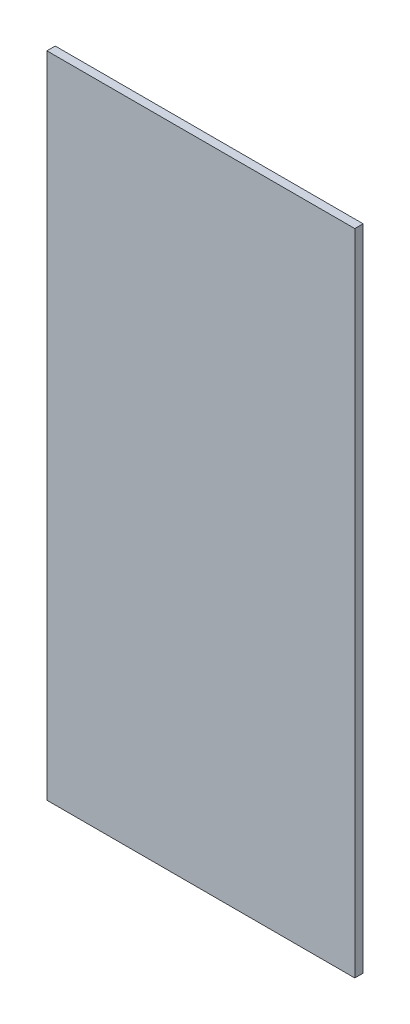
ISO-10303-21;
HEADER;
FILE_DESCRIPTION(('STEP AP214'),'2;1');
FILE_NAME('part.step','',(''),(''),'','','');
FILE_SCHEMA(('AUTOMOTIVE_DESIGN { 1 0 10303 214 1 1 1 1 }'));
ENDSEC;
DATA;
#1=APPLICATION_CONTEXT('core data for automotive mechanical design processes');
#2=APPLICATION_PROTOCOL_DEFINITION('international standard','automotive_design',2000,#1);
#3=PRODUCT_CONTEXT('',#1,'mechanical');
#4=PRODUCT('Part','Part','',(#3));
#5=PRODUCT_RELATED_PRODUCT_CATEGORY('part','',(#4));
#6=PRODUCT_DEFINITION_FORMATION('','',#4);
#7=PRODUCT_DEFINITION_CONTEXT('part definition',#1,'design');
#8=PRODUCT_DEFINITION('design','',#6,#7);
#9=PRODUCT_DEFINITION_SHAPE('','',#8);
#10=(LENGTH_UNIT() NAMED_UNIT(*) SI_UNIT(.MILLI.,.METRE.));
#11=(NAMED_UNIT(*) PLANE_ANGLE_UNIT() SI_UNIT($,.RADIAN.));
#12=(NAMED_UNIT(*) SI_UNIT($,.STERADIAN.) SOLID_ANGLE_UNIT());
#13=UNCERTAINTY_MEASURE_WITH_UNIT(LENGTH_MEASURE(1.E-05),#10,'distance_accuracy_value','');
#14=(GEOMETRIC_REPRESENTATION_CONTEXT(3) GLOBAL_UNCERTAINTY_ASSIGNED_CONTEXT((#13)) GLOBAL_UNIT_ASSIGNED_CONTEXT((#10,
#11,#12)) REPRESENTATION_CONTEXT('',''));
#15=CARTESIAN_POINT('',(0.,0.,0.));
#16=DIRECTION('',(0.,0.,1.));
#17=DIRECTION('',(1.,0.,0.));
#18=AXIS2_PLACEMENT_3D('',#15,#16,#17);
#19=CARTESIAN_POINT('',(117.475,495.3,-3.175));
#20=DIRECTION('',(-1.,0.,0.));
#21=DIRECTION('',(0.,0.,1.));
#22=AXIS2_PLACEMENT_3D('',#19,#20,#21);
#23=PLANE('',#22);
#24=DIRECTION('',(0.,0.,-1.));
#25=VECTOR('',#24,1.);
#26=CARTESIAN_POINT('',(117.475,0.,-3.175));
#27=LINE('',#26,#25);
#28=CARTESIAN_POINT('',(117.475,0.,3.175));
#29=VERTEX_POINT('',#28);
#30=CARTESIAN_POINT('',(117.475,0.,-3.175));
#31=VERTEX_POINT('',#30);
#32=EDGE_CURVE('E97',#29,#31,#27,.T.);
#33=ORIENTED_EDGE('',*,*,#32,.T.);
#34=DIRECTION('',(0.,-1.,0.));
#35=VECTOR('',#34,1.);
#36=CARTESIAN_POINT('',(117.475,495.3,-3.175));
#37=LINE('',#36,#35);
#38=CARTESIAN_POINT('',(117.475,495.3,-3.175));
#39=VERTEX_POINT('',#38);
#40=EDGE_CURVE('E11',#39,#31,#37,.T.);
#41=ORIENTED_EDGE('',*,*,#40,.F.);
#42=DIRECTION('',(0.,0.,-1.));
#43=VECTOR('',#42,1.);
#44=CARTESIAN_POINT('',(117.475,495.3,-3.175));
#45=LINE('',#44,#43);
#46=CARTESIAN_POINT('',(117.475,495.3,3.175));
#47=VERTEX_POINT('',#46);
#48=EDGE_CURVE('E85',#47,#39,#45,.T.);
#49=ORIENTED_EDGE('',*,*,#48,.F.);
#50=DIRECTION('',(0.,-1.,0.));
#51=VECTOR('',#50,1.);
#52=CARTESIAN_POINT('',(117.475,495.3,3.175));
#53=LINE('',#52,#51);
#54=EDGE_CURVE('E93',#47,#29,#53,.T.);
#55=ORIENTED_EDGE('',*,*,#54,.T.);
#56=EDGE_LOOP('',(#33,#41,#49,#55));
#57=FACE_BOUND('',#56,.T.);
#58=ADVANCED_FACE('F34',(#57),#23,.F.);
#59=CARTESIAN_POINT('',(-117.475,495.3,-3.175));
#60=DIRECTION('',(0.,0.,1.));
#61=DIRECTION('',(1.,0.,0.));
#62=AXIS2_PLACEMENT_3D('',#59,#60,#61);
#63=PLANE('',#62);
#64=DIRECTION('',(-1.,0.,0.));
#65=VECTOR('',#64,1.);
#66=CARTESIAN_POINT('',(-117.475,0.,-3.175));
#67=LINE('',#66,#65);
#68=CARTESIAN_POINT('',(-117.475,0.,-3.175));
#69=VERTEX_POINT('',#68);
#70=EDGE_CURVE('E89',#31,#69,#67,.T.);
#71=ORIENTED_EDGE('',*,*,#70,.T.);
#72=DIRECTION('',(0.,-1.,0.));
#73=VECTOR('',#72,1.);
#74=CARTESIAN_POINT('',(-117.475,495.3,-3.175));
#75=LINE('',#74,#73);
#76=CARTESIAN_POINT('',(-117.475,495.3,-3.175));
#77=VERTEX_POINT('',#76);
#78=EDGE_CURVE('E42',#77,#69,#75,.T.);
#79=ORIENTED_EDGE('',*,*,#78,.F.);
#80=DIRECTION('',(-1.,0.,0.));
#81=VECTOR('',#80,1.);
#82=CARTESIAN_POINT('',(-117.475,495.3,-3.175));
#83=LINE('',#82,#81);
#84=EDGE_CURVE('E80',#39,#77,#83,.T.);
#85=ORIENTED_EDGE('',*,*,#84,.F.);
#86=ORIENTED_EDGE('',*,*,#40,.T.);
#87=EDGE_LOOP('',(#71,#79,#85,#86));
#88=FACE_BOUND('',#87,.T.);
#89=ADVANCED_FACE('F88',(#88),#63,.F.);
#90=CARTESIAN_POINT('',(-117.475,495.3,-3.175));
#91=DIRECTION('',(1.,0.,0.));
#92=DIRECTION('',(0.,0.,-1.));
#93=AXIS2_PLACEMENT_3D('',#90,#91,#92);
#94=PLANE('',#93);
#95=DIRECTION('',(0.,0.,1.));
#96=VECTOR('',#95,1.);
#97=CARTESIAN_POINT('',(-117.475,0.,-3.175));
#98=LINE('',#97,#96);
#99=CARTESIAN_POINT('',(-117.475,0.,3.175));
#100=VERTEX_POINT('',#99);
#101=EDGE_CURVE('E67',#69,#100,#98,.T.);
#102=ORIENTED_EDGE('',*,*,#101,.T.);
#103=DIRECTION('',(0.,-1.,0.));
#104=VECTOR('',#103,1.);
#105=CARTESIAN_POINT('',(-117.475,495.3,3.175));
#106=LINE('',#105,#104);
#107=CARTESIAN_POINT('',(-117.475,495.3,3.175));
#108=VERTEX_POINT('',#107);
#109=EDGE_CURVE('E90',#108,#100,#106,.T.);
#110=ORIENTED_EDGE('',*,*,#109,.F.);
#111=DIRECTION('',(0.,0.,1.));
#112=VECTOR('',#111,1.);
#113=CARTESIAN_POINT('',(-117.475,495.3,-3.175));
#114=LINE('',#113,#112);
#115=EDGE_CURVE('E83',#77,#108,#114,.T.);
#116=ORIENTED_EDGE('',*,*,#115,.F.);
#117=ORIENTED_EDGE('',*,*,#78,.T.);
#118=EDGE_LOOP('',(#102,#110,#116,#117));
#119=FACE_BOUND('',#118,.T.);
#120=ADVANCED_FACE('F91',(#119),#94,.F.);
#121=CARTESIAN_POINT('',(-117.475,495.3,3.175));
#122=DIRECTION('',(0.,0.,-1.));
#123=DIRECTION('',(-1.,0.,0.));
#124=AXIS2_PLACEMENT_3D('',#121,#122,#123);
#125=PLANE('',#124);
#126=DIRECTION('',(1.,0.,0.));
#127=VECTOR('',#126,1.);
#128=CARTESIAN_POINT('',(-117.475,0.,3.175));
#129=LINE('',#128,#127);
#130=EDGE_CURVE('E73',#100,#29,#129,.T.);
#131=ORIENTED_EDGE('',*,*,#130,.T.);
#132=ORIENTED_EDGE('',*,*,#54,.F.);
#133=DIRECTION('',(1.,0.,0.));
#134=VECTOR('',#133,1.);
#135=CARTESIAN_POINT('',(-117.475,495.3,3.175));
#136=LINE('',#135,#134);
#137=EDGE_CURVE('E50',#108,#47,#136,.T.);
#138=ORIENTED_EDGE('',*,*,#137,.F.);
#139=ORIENTED_EDGE('',*,*,#109,.T.);
#140=EDGE_LOOP('',(#131,#132,#138,#139));
#141=FACE_BOUND('',#140,.T.);
#142=ADVANCED_FACE('F104',(#141),#125,.F.);
#143=CARTESIAN_POINT('',(0.,495.3,0.));
#144=DIRECTION('',(0.,1.,0.));
#145=DIRECTION('',(0.,0.,1.));
#146=AXIS2_PLACEMENT_3D('',#143,#144,#145);
#147=PLANE('',#146);
#148=ORIENTED_EDGE('',*,*,#48,.T.);
#149=ORIENTED_EDGE('',*,*,#84,.T.);
#150=ORIENTED_EDGE('',*,*,#115,.T.);
#151=ORIENTED_EDGE('',*,*,#137,.T.);
#152=EDGE_LOOP('',(#148,#149,#150,#151));
#153=FACE_BOUND('',#152,.T.);
#154=ADVANCED_FACE('F81',(#153),#147,.T.);
#155=CARTESIAN_POINT('',(0.,0.,0.));
#156=DIRECTION('',(0.,1.,0.));
#157=DIRECTION('',(0.,0.,1.));
#158=AXIS2_PLACEMENT_3D('',#155,#156,#157);
#159=PLANE('',#158);
#160=ORIENTED_EDGE('',*,*,#32,.F.);
#161=ORIENTED_EDGE('',*,*,#130,.F.);
#162=ORIENTED_EDGE('',*,*,#101,.F.);
#163=ORIENTED_EDGE('',*,*,#70,.F.);
#164=EDGE_LOOP('',(#160,#161,#162,#163));
#165=FACE_BOUND('',#164,.T.);
#166=ADVANCED_FACE('F107',(#165),#159,.F.);
#167=CLOSED_SHELL('',(#58,#89,#120,#142,#154,#166));
#168=MANIFOLD_SOLID_BREP('B2',#167);
#169=ADVANCED_BREP_SHAPE_REPRESENTATION('',(#18,#168),#14);
#170=SHAPE_DEFINITION_REPRESENTATION(#9,#169);
ENDSEC;
END-ISO-10303-21;
